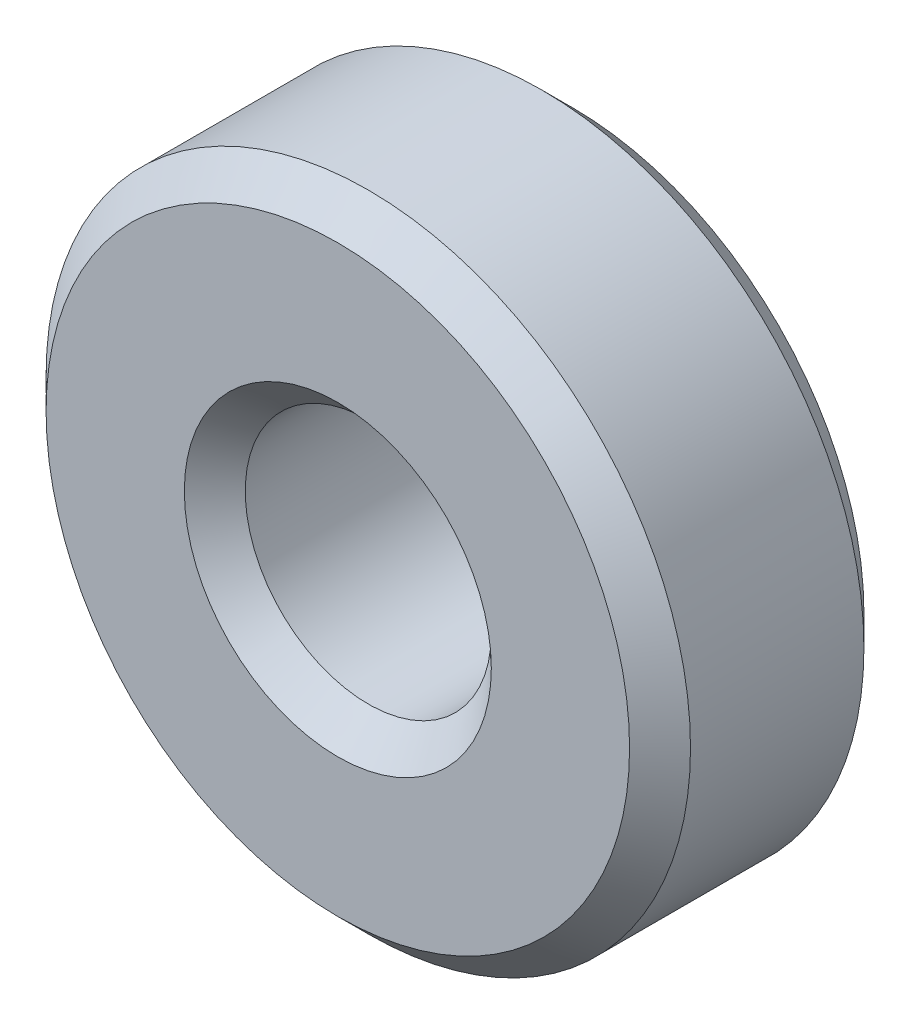
ISO-10303-21;
HEADER;
FILE_DESCRIPTION(('STEP AP214'),'2;1');
FILE_NAME('part.step','',(''),(''),'','','');
FILE_SCHEMA(('AUTOMOTIVE_DESIGN { 1 0 10303 214 1 1 1 1 }'));
ENDSEC;
DATA;
#1=APPLICATION_CONTEXT('core data for automotive mechanical design processes');
#2=APPLICATION_PROTOCOL_DEFINITION('international standard','automotive_design',2000,#1);
#3=PRODUCT_CONTEXT('',#1,'mechanical');
#4=PRODUCT('Part','Part','',(#3));
#5=PRODUCT_RELATED_PRODUCT_CATEGORY('part','',(#4));
#6=PRODUCT_DEFINITION_FORMATION('','',#4);
#7=PRODUCT_DEFINITION_CONTEXT('part definition',#1,'design');
#8=PRODUCT_DEFINITION('design','',#6,#7);
#9=PRODUCT_DEFINITION_SHAPE('','',#8);
#10=(LENGTH_UNIT() NAMED_UNIT(*) SI_UNIT(.MILLI.,.METRE.));
#11=(NAMED_UNIT(*) PLANE_ANGLE_UNIT() SI_UNIT($,.RADIAN.));
#12=(NAMED_UNIT(*) SI_UNIT($,.STERADIAN.) SOLID_ANGLE_UNIT());
#13=UNCERTAINTY_MEASURE_WITH_UNIT(LENGTH_MEASURE(1.E-05),#10,'distance_accuracy_value','');
#14=(GEOMETRIC_REPRESENTATION_CONTEXT(3) GLOBAL_UNCERTAINTY_ASSIGNED_CONTEXT((#13)) GLOBAL_UNIT_ASSIGNED_CONTEXT((#10,
#11,#12)) REPRESENTATION_CONTEXT('',''));
#15=CARTESIAN_POINT('',(0.,0.,0.));
#16=DIRECTION('',(0.,0.,1.));
#17=DIRECTION('',(1.,0.,0.));
#18=AXIS2_PLACEMENT_3D('',#15,#16,#17);
#19=CARTESIAN_POINT('',(0.,0.,5.));
#20=DIRECTION('',(0.,0.,1.));
#21=DIRECTION('',(1.,0.,0.));
#22=AXIS2_PLACEMENT_3D('',#19,#20,#21);
#23=PLANE('',#22);
#24=CARTESIAN_POINT('',(0.,0.,5.));
#25=DIRECTION('',(0.,0.,1.));
#26=DIRECTION('',(1.,0.,0.));
#27=AXIS2_PLACEMENT_3D('',#24,#25,#26);
#28=CIRCLE('',#27,3.27500000000001);
#29=CARTESIAN_POINT('',(3.27500000000001,0.,5.));
#30=VERTEX_POINT('',#29);
#31=EDGE_CURVE('E10',#30,#30,#28,.F.);
#32=ORIENTED_EDGE('',*,*,#31,.T.);
#33=EDGE_LOOP('',(#32));
#34=FACE_BOUND('',#33,.T.);
#35=CARTESIAN_POINT('',(0.,0.,5.));
#36=DIRECTION('',(0.,0.,1.));
#37=DIRECTION('',(1.,0.,0.));
#38=AXIS2_PLACEMENT_3D('',#35,#36,#37);
#39=CIRCLE('',#38,6.22499999999999);
#40=CARTESIAN_POINT('',(6.22499999999999,0.,5.));
#41=VERTEX_POINT('',#40);
#42=EDGE_CURVE('E41',#41,#41,#39,.T.);
#43=ORIENTED_EDGE('',*,*,#42,.T.);
#44=EDGE_LOOP('',(#43));
#45=FACE_BOUND('',#44,.T.);
#46=ADVANCED_FACE('F33',(#34,#45),#23,.T.);
#47=CARTESIAN_POINT('',(0.,0.,0.));
#48=DIRECTION('',(0.,0.,1.));
#49=DIRECTION('',(1.,0.,0.));
#50=AXIS2_PLACEMENT_3D('',#47,#48,#49);
#51=PLANE('',#50);
#52=CARTESIAN_POINT('',(0.,0.,0.));
#53=DIRECTION('',(0.,0.,1.));
#54=DIRECTION('',(1.,0.,0.));
#55=AXIS2_PLACEMENT_3D('',#52,#53,#54);
#56=CIRCLE('',#55,3.275);
#57=CARTESIAN_POINT('',(3.275,0.,0.));
#58=VERTEX_POINT('',#57);
#59=EDGE_CURVE('E60',#58,#58,#56,.T.);
#60=ORIENTED_EDGE('',*,*,#59,.T.);
#61=EDGE_LOOP('',(#60));
#62=FACE_BOUND('',#61,.T.);
#63=CARTESIAN_POINT('',(0.,0.,0.));
#64=DIRECTION('',(0.,0.,1.));
#65=DIRECTION('',(1.,0.,0.));
#66=AXIS2_PLACEMENT_3D('',#63,#64,#65);
#67=CIRCLE('',#66,6.225);
#68=CARTESIAN_POINT('',(6.225,0.,0.));
#69=VERTEX_POINT('',#68);
#70=EDGE_CURVE('E63',#69,#69,#67,.F.);
#71=ORIENTED_EDGE('',*,*,#70,.T.);
#72=EDGE_LOOP('',(#71));
#73=FACE_BOUND('',#72,.T.);
#74=ADVANCED_FACE('F67',(#62,#73),#51,.F.);
#75=CARTESIAN_POINT('',(0.,0.,5.));
#76=DIRECTION('',(0.,0.,-1.));
#77=DIRECTION('',(-1.,0.,0.));
#78=AXIS2_PLACEMENT_3D('',#75,#76,#77);
#79=CYLINDRICAL_SURFACE('',#78,6.875);
#80=CARTESIAN_POINT('',(0.,0.,0.65));
#81=DIRECTION('',(0.,0.,1.));
#82=DIRECTION('',(1.,0.,0.));
#83=AXIS2_PLACEMENT_3D('',#80,#81,#82);
#84=CIRCLE('',#83,6.875);
#85=CARTESIAN_POINT('',(6.875,0.,0.65));
#86=VERTEX_POINT('',#85);
#87=EDGE_CURVE('E45',#86,#86,#84,.T.);
#88=ORIENTED_EDGE('',*,*,#87,.T.);
#89=EDGE_LOOP('',(#88));
#90=FACE_BOUND('',#89,.T.);
#91=CARTESIAN_POINT('',(0.,0.,4.34999999999999));
#92=DIRECTION('',(0.,0.,1.));
#93=DIRECTION('',(1.,0.,0.));
#94=AXIS2_PLACEMENT_3D('',#91,#92,#93);
#95=CIRCLE('',#94,6.875);
#96=CARTESIAN_POINT('',(6.875,0.,4.34999999999999));
#97=VERTEX_POINT('',#96);
#98=EDGE_CURVE('E49',#97,#97,#95,.F.);
#99=ORIENTED_EDGE('',*,*,#98,.T.);
#100=EDGE_LOOP('',(#99));
#101=FACE_BOUND('',#100,.T.);
#102=ADVANCED_FACE('F77',(#90,#101),#79,.T.);
#103=CARTESIAN_POINT('',(0.,0.,5.));
#104=DIRECTION('',(0.,0.,-1.));
#105=DIRECTION('',(-1.,0.,0.));
#106=AXIS2_PLACEMENT_3D('',#103,#104,#105);
#107=CYLINDRICAL_SURFACE('',#106,2.625);
#108=CARTESIAN_POINT('',(0.,0.,0.649999999999999));
#109=DIRECTION('',(0.,0.,1.));
#110=DIRECTION('',(1.,0.,0.));
#111=AXIS2_PLACEMENT_3D('',#108,#109,#110);
#112=CIRCLE('',#111,2.625);
#113=CARTESIAN_POINT('',(2.625,0.,0.649999999999999));
#114=VERTEX_POINT('',#113);
#115=EDGE_CURVE('E54',#114,#114,#112,.F.);
#116=ORIENTED_EDGE('',*,*,#115,.T.);
#117=EDGE_LOOP('',(#116));
#118=FACE_BOUND('',#117,.T.);
#119=CARTESIAN_POINT('',(0.,0.,4.35));
#120=DIRECTION('',(0.,0.,1.));
#121=DIRECTION('',(1.,0.,0.));
#122=AXIS2_PLACEMENT_3D('',#119,#120,#121);
#123=CIRCLE('',#122,2.625);
#124=CARTESIAN_POINT('',(2.625,0.,4.35));
#125=VERTEX_POINT('',#124);
#126=EDGE_CURVE('E57',#125,#125,#123,.T.);
#127=ORIENTED_EDGE('',*,*,#126,.T.);
#128=EDGE_LOOP('',(#127));
#129=FACE_BOUND('',#128,.T.);
#130=ADVANCED_FACE('F80',(#118,#129),#107,.F.);
#131=CARTESIAN_POINT('',(0.,0.,0.));
#132=DIRECTION('',(0.,0.,-1.));
#133=DIRECTION('',(-1.,0.,0.));
#134=AXIS2_PLACEMENT_3D('',#131,#132,#133);
#135=CONICAL_SURFACE('',#134,3.275,0.785398163397447);
#136=ORIENTED_EDGE('',*,*,#115,.F.);
#137=EDGE_LOOP('',(#136));
#138=FACE_BOUND('',#137,.T.);
#139=ORIENTED_EDGE('',*,*,#59,.F.);
#140=EDGE_LOOP('',(#139));
#141=FACE_BOUND('',#140,.T.);
#142=ADVANCED_FACE('F73',(#138,#141),#135,.F.);
#143=CARTESIAN_POINT('',(0.,0.,0.65));
#144=DIRECTION('',(0.,0.,1.));
#145=DIRECTION('',(1.,0.,0.));
#146=AXIS2_PLACEMENT_3D('',#143,#144,#145);
#147=CONICAL_SURFACE('',#146,6.875,0.78539816339745);
#148=ORIENTED_EDGE('',*,*,#70,.F.);
#149=EDGE_LOOP('',(#148));
#150=FACE_BOUND('',#149,.T.);
#151=ORIENTED_EDGE('',*,*,#87,.F.);
#152=EDGE_LOOP('',(#151));
#153=FACE_BOUND('',#152,.T.);
#154=ADVANCED_FACE('F69',(#150,#153),#147,.T.);
#155=CARTESIAN_POINT('',(0.,0.,4.35));
#156=DIRECTION('',(0.,0.,1.));
#157=DIRECTION('',(1.,0.,0.));
#158=AXIS2_PLACEMENT_3D('',#155,#156,#157);
#159=CONICAL_SURFACE('',#158,2.625,0.785398163397451);
#160=ORIENTED_EDGE('',*,*,#31,.F.);
#161=EDGE_LOOP('',(#160));
#162=FACE_BOUND('',#161,.T.);
#163=ORIENTED_EDGE('',*,*,#126,.F.);
#164=EDGE_LOOP('',(#163));
#165=FACE_BOUND('',#164,.T.);
#166=ADVANCED_FACE('F72',(#162,#165),#159,.F.);
#167=CARTESIAN_POINT('',(0.,0.,5.));
#168=DIRECTION('',(0.,0.,-1.));
#169=DIRECTION('',(-1.,0.,0.));
#170=AXIS2_PLACEMENT_3D('',#167,#168,#169);
#171=CONICAL_SURFACE('',#170,6.22499999999999,0.785398163397446);
#172=ORIENTED_EDGE('',*,*,#98,.F.);
#173=EDGE_LOOP('',(#172));
#174=FACE_BOUND('',#173,.T.);
#175=ORIENTED_EDGE('',*,*,#42,.F.);
#176=EDGE_LOOP('',(#175));
#177=FACE_BOUND('',#176,.T.);
#178=ADVANCED_FACE('F36',(#174,#177),#171,.T.);
#179=CLOSED_SHELL('',(#46,#74,#102,#130,#142,#154,#166,#178));
#180=MANIFOLD_SOLID_BREP('B2',#179);
#181=ADVANCED_BREP_SHAPE_REPRESENTATION('',(#18,#180),#14);
#182=SHAPE_DEFINITION_REPRESENTATION(#9,#181);
ENDSEC;
END-ISO-10303-21;
